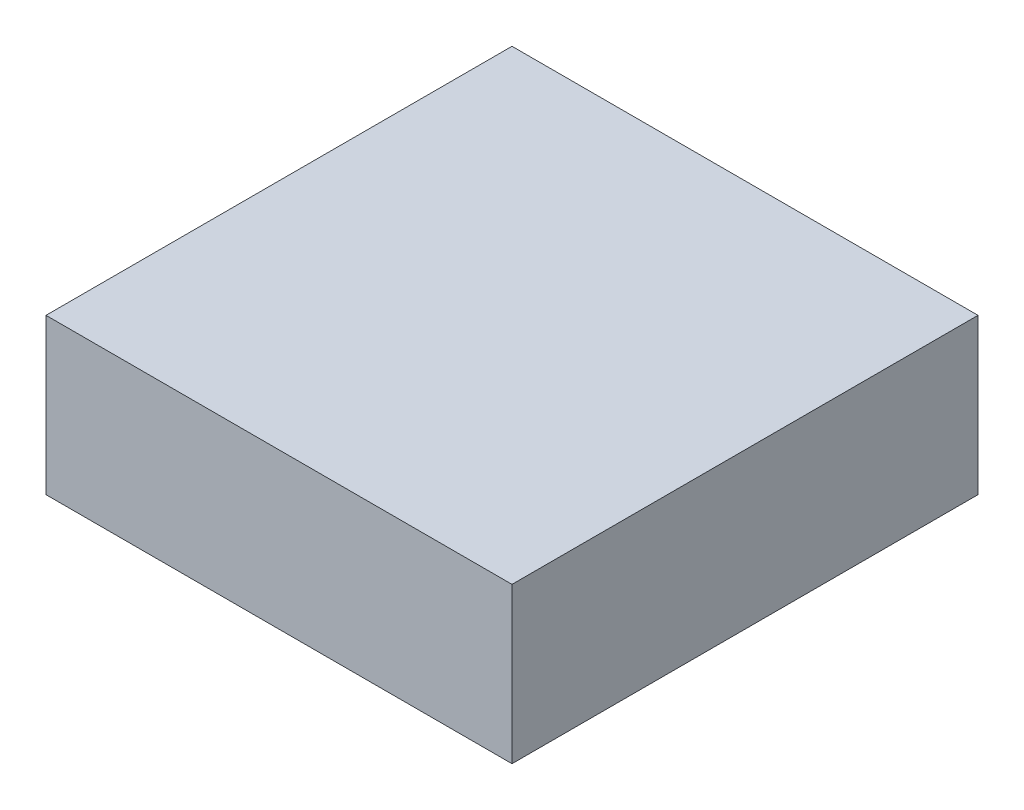
ISO-10303-21;
HEADER;
FILE_DESCRIPTION(('STEP AP214'),'2;1');
FILE_NAME('part.step','',(''),(''),'','','');
FILE_SCHEMA(('AUTOMOTIVE_DESIGN { 1 0 10303 214 1 1 1 1 }'));
ENDSEC;
DATA;
#1=APPLICATION_CONTEXT('core data for automotive mechanical design processes');
#2=APPLICATION_PROTOCOL_DEFINITION('international standard','automotive_design',2000,#1);
#3=PRODUCT_CONTEXT('',#1,'mechanical');
#4=PRODUCT('Part','Part','',(#3));
#5=PRODUCT_RELATED_PRODUCT_CATEGORY('part','',(#4));
#6=PRODUCT_DEFINITION_FORMATION('','',#4);
#7=PRODUCT_DEFINITION_CONTEXT('part definition',#1,'design');
#8=PRODUCT_DEFINITION('design','',#6,#7);
#9=PRODUCT_DEFINITION_SHAPE('','',#8);
#10=(LENGTH_UNIT() NAMED_UNIT(*) SI_UNIT(.MILLI.,.METRE.));
#11=(NAMED_UNIT(*) PLANE_ANGLE_UNIT() SI_UNIT($,.RADIAN.));
#12=(NAMED_UNIT(*) SI_UNIT($,.STERADIAN.) SOLID_ANGLE_UNIT());
#13=UNCERTAINTY_MEASURE_WITH_UNIT(LENGTH_MEASURE(1.E-05),#10,'distance_accuracy_value','');
#14=(GEOMETRIC_REPRESENTATION_CONTEXT(3) GLOBAL_UNCERTAINTY_ASSIGNED_CONTEXT((#13)) GLOBAL_UNIT_ASSIGNED_CONTEXT((#10,
#11,#12)) REPRESENTATION_CONTEXT('',''));
#15=CARTESIAN_POINT('',(0.,0.,0.));
#16=DIRECTION('',(0.,0.,1.));
#17=DIRECTION('',(1.,0.,0.));
#18=AXIS2_PLACEMENT_3D('',#15,#16,#17);
#19=CARTESIAN_POINT('',(-0.67499992,-0.22499828,0.));
#20=DIRECTION('',(0.,1.,0.));
#21=DIRECTION('',(1.,0.,0.));
#22=AXIS2_PLACEMENT_3D('',#19,#20,#21);
#23=PLANE('',#22);
#24=DIRECTION('',(1.,0.,0.));
#25=VECTOR('',#24,1.);
#26=CARTESIAN_POINT('',(-0.67499992,-0.22499828,0.));
#27=LINE('',#26,#25);
#28=CARTESIAN_POINT('',(-0.67499992,-0.22499828,0.));
#29=VERTEX_POINT('',#28);
#30=CARTESIAN_POINT('',(0.67499992,-0.22499828,0.));
#31=VERTEX_POINT('',#30);
#32=EDGE_CURVE('E11',#29,#31,#27,.T.);
#33=ORIENTED_EDGE('',*,*,#32,.T.);
#34=DIRECTION('',(0.,0.,1.));
#35=VECTOR('',#34,1.);
#36=CARTESIAN_POINT('',(0.67499992,-0.22499828,0.));
#37=LINE('',#36,#35);
#38=CARTESIAN_POINT('',(0.67499992,-0.22499828,1.34999984));
#39=VERTEX_POINT('',#38);
#40=EDGE_CURVE('E26',#31,#39,#37,.T.);
#41=ORIENTED_EDGE('',*,*,#40,.T.);
#42=DIRECTION('',(1.,0.,0.));
#43=VECTOR('',#42,1.);
#44=CARTESIAN_POINT('',(-0.67499992,-0.22499828,1.34999984));
#45=LINE('',#44,#43);
#46=CARTESIAN_POINT('',(-0.67499992,-0.22499828,1.34999984));
#47=VERTEX_POINT('',#46);
#48=EDGE_CURVE('E74',#47,#39,#45,.T.);
#49=ORIENTED_EDGE('',*,*,#48,.F.);
#50=DIRECTION('',(0.,0.,1.));
#51=VECTOR('',#50,1.);
#52=CARTESIAN_POINT('',(-0.67499992,-0.22499828,0.));
#53=LINE('',#52,#51);
#54=EDGE_CURVE('E99',#29,#47,#53,.T.);
#55=ORIENTED_EDGE('',*,*,#54,.F.);
#56=EDGE_LOOP('',(#33,#41,#49,#55));
#57=FACE_BOUND('',#56,.T.);
#58=ADVANCED_FACE('F16',(#57),#23,.F.);
#59=CARTESIAN_POINT('',(0.67499992,-0.22499828,0.));
#60=DIRECTION('',(-1.,0.,0.));
#61=DIRECTION('',(0.,0.,1.));
#62=AXIS2_PLACEMENT_3D('',#59,#60,#61);
#63=PLANE('',#62);
#64=DIRECTION('',(0.,1.,0.));
#65=VECTOR('',#64,1.);
#66=CARTESIAN_POINT('',(0.67499992,-0.22499828,0.));
#67=LINE('',#66,#65);
#68=CARTESIAN_POINT('',(0.67499992,0.22500082,0.));
#69=VERTEX_POINT('',#68);
#70=EDGE_CURVE('E79',#31,#69,#67,.T.);
#71=ORIENTED_EDGE('',*,*,#70,.T.);
#72=DIRECTION('',(0.,0.,1.));
#73=VECTOR('',#72,1.);
#74=CARTESIAN_POINT('',(0.67499992,0.22500082,0.));
#75=LINE('',#74,#73);
#76=CARTESIAN_POINT('',(0.67499992,0.22500082,1.34999984));
#77=VERTEX_POINT('',#76);
#78=EDGE_CURVE('E59',#69,#77,#75,.T.);
#79=ORIENTED_EDGE('',*,*,#78,.T.);
#80=DIRECTION('',(0.,1.,0.));
#81=VECTOR('',#80,1.);
#82=CARTESIAN_POINT('',(0.67499992,-0.22499828,1.34999984));
#83=LINE('',#82,#81);
#84=EDGE_CURVE('E68',#39,#77,#83,.T.);
#85=ORIENTED_EDGE('',*,*,#84,.F.);
#86=ORIENTED_EDGE('',*,*,#40,.F.);
#87=EDGE_LOOP('',(#71,#79,#85,#86));
#88=FACE_BOUND('',#87,.T.);
#89=ADVANCED_FACE('F77',(#88),#63,.F.);
#90=CARTESIAN_POINT('',(0.67499992,0.22500082,0.));
#91=DIRECTION('',(0.,-1.,0.));
#92=DIRECTION('',(0.,0.,-1.));
#93=AXIS2_PLACEMENT_3D('',#90,#91,#92);
#94=PLANE('',#93);
#95=DIRECTION('',(-1.,0.,0.));
#96=VECTOR('',#95,1.);
#97=CARTESIAN_POINT('',(0.67499992,0.22500082,0.));
#98=LINE('',#97,#96);
#99=CARTESIAN_POINT('',(-0.67499992,0.22500082,0.));
#100=VERTEX_POINT('',#99);
#101=EDGE_CURVE('E82',#69,#100,#98,.T.);
#102=ORIENTED_EDGE('',*,*,#101,.T.);
#103=DIRECTION('',(0.,0.,1.));
#104=VECTOR('',#103,1.);
#105=CARTESIAN_POINT('',(-0.67499992,0.22500082,0.));
#106=LINE('',#105,#104);
#107=CARTESIAN_POINT('',(-0.67499992,0.22500082,1.34999984));
#108=VERTEX_POINT('',#107);
#109=EDGE_CURVE('E84',#100,#108,#106,.T.);
#110=ORIENTED_EDGE('',*,*,#109,.T.);
#111=DIRECTION('',(-1.,0.,0.));
#112=VECTOR('',#111,1.);
#113=CARTESIAN_POINT('',(0.67499992,0.22500082,1.34999984));
#114=LINE('',#113,#112);
#115=EDGE_CURVE('E71',#77,#108,#114,.T.);
#116=ORIENTED_EDGE('',*,*,#115,.F.);
#117=ORIENTED_EDGE('',*,*,#78,.F.);
#118=EDGE_LOOP('',(#102,#110,#116,#117));
#119=FACE_BOUND('',#118,.T.);
#120=ADVANCED_FACE('F18',(#119),#94,.F.);
#121=CARTESIAN_POINT('',(-0.67499992,0.22500082,0.));
#122=DIRECTION('',(1.,0.,0.));
#123=DIRECTION('',(0.,1.,0.));
#124=AXIS2_PLACEMENT_3D('',#121,#122,#123);
#125=PLANE('',#124);
#126=DIRECTION('',(0.,-1.,0.));
#127=VECTOR('',#126,1.);
#128=CARTESIAN_POINT('',(-0.67499992,0.22500082,0.));
#129=LINE('',#128,#127);
#130=EDGE_CURVE('E102',#100,#29,#129,.T.);
#131=ORIENTED_EDGE('',*,*,#130,.T.);
#132=ORIENTED_EDGE('',*,*,#54,.T.);
#133=DIRECTION('',(0.,-1.,0.));
#134=VECTOR('',#133,1.);
#135=CARTESIAN_POINT('',(-0.67499992,0.22500082,1.34999984));
#136=LINE('',#135,#134);
#137=EDGE_CURVE('E87',#108,#47,#136,.T.);
#138=ORIENTED_EDGE('',*,*,#137,.F.);
#139=ORIENTED_EDGE('',*,*,#109,.F.);
#140=EDGE_LOOP('',(#131,#132,#138,#139));
#141=FACE_BOUND('',#140,.T.);
#142=ADVANCED_FACE('F162',(#141),#125,.F.);
#143=CARTESIAN_POINT('',(-0.67499992,-0.22499828,0.));
#144=DIRECTION('',(0.,0.,-1.));
#145=DIRECTION('',(0.,-1.,0.));
#146=AXIS2_PLACEMENT_3D('',#143,#144,#145);
#147=PLANE('',#146);
#148=ORIENTED_EDGE('',*,*,#130,.F.);
#149=ORIENTED_EDGE('',*,*,#101,.F.);
#150=ORIENTED_EDGE('',*,*,#70,.F.);
#151=ORIENTED_EDGE('',*,*,#32,.F.);
#152=EDGE_LOOP('',(#148,#149,#150,#151));
#153=FACE_BOUND('',#152,.T.);
#154=ADVANCED_FACE('F151',(#153),#147,.T.);
#155=CARTESIAN_POINT('',(-0.67499992,-0.22499828,1.34999984));
#156=DIRECTION('',(0.,0.,-1.));
#157=DIRECTION('',(0.,-1.,0.));
#158=AXIS2_PLACEMENT_3D('',#155,#156,#157);
#159=PLANE('',#158);
#160=ORIENTED_EDGE('',*,*,#48,.T.);
#161=ORIENTED_EDGE('',*,*,#84,.T.);
#162=ORIENTED_EDGE('',*,*,#115,.T.);
#163=ORIENTED_EDGE('',*,*,#137,.T.);
#164=EDGE_LOOP('',(#160,#161,#162,#163));
#165=FACE_BOUND('',#164,.T.);
#166=ADVANCED_FACE('F69',(#165),#159,.F.);
#167=CLOSED_SHELL('',(#58,#89,#120,#142,#154,#166));
#168=MANIFOLD_SOLID_BREP('B1',#167);
#169=ADVANCED_BREP_SHAPE_REPRESENTATION('',(#18,#168),#14);
#170=SHAPE_DEFINITION_REPRESENTATION(#9,#169);
ENDSEC;
END-ISO-10303-21;
